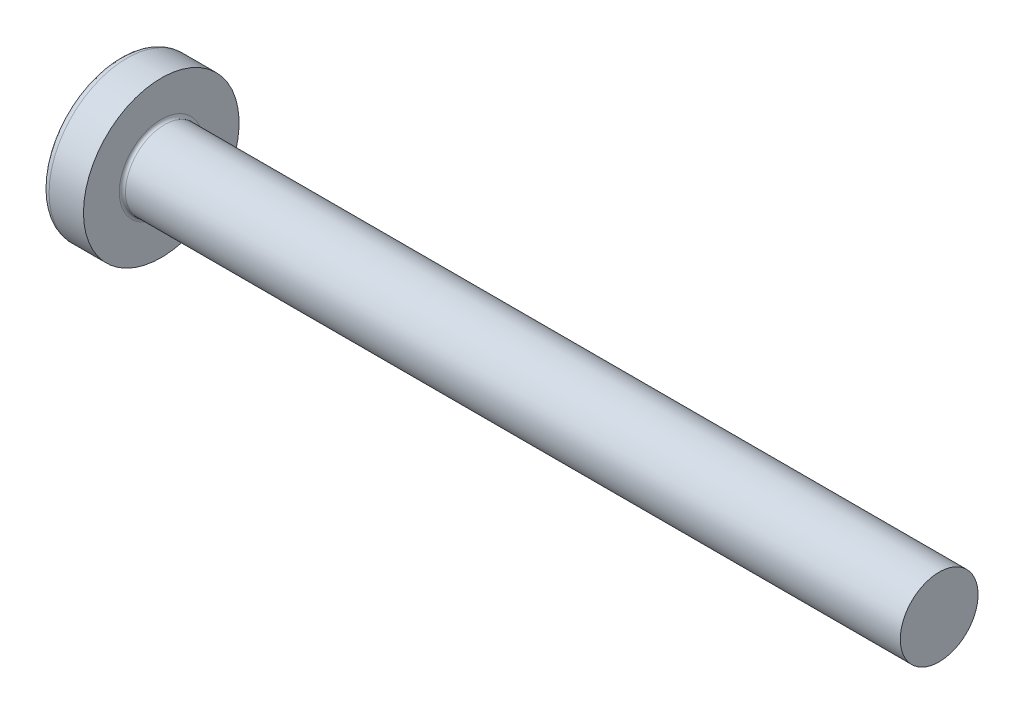
ISO-10303-21;
HEADER;
FILE_DESCRIPTION(('STEP AP214'),'2;1');
FILE_NAME('part.step','',(''),(''),'','','');
FILE_SCHEMA(('AUTOMOTIVE_DESIGN { 1 0 10303 214 1 1 1 1 }'));
ENDSEC;
DATA;
#1=APPLICATION_CONTEXT('core data for automotive mechanical design processes');
#2=APPLICATION_PROTOCOL_DEFINITION('international standard','automotive_design',2000,#1);
#3=PRODUCT_CONTEXT('',#1,'mechanical');
#4=PRODUCT('Part','Part','',(#3));
#5=PRODUCT_RELATED_PRODUCT_CATEGORY('part','',(#4));
#6=PRODUCT_DEFINITION_FORMATION('','',#4);
#7=PRODUCT_DEFINITION_CONTEXT('part definition',#1,'design');
#8=PRODUCT_DEFINITION('design','',#6,#7);
#9=PRODUCT_DEFINITION_SHAPE('','',#8);
#10=(LENGTH_UNIT() NAMED_UNIT(*) SI_UNIT(.MILLI.,.METRE.));
#11=(NAMED_UNIT(*) PLANE_ANGLE_UNIT() SI_UNIT($,.RADIAN.));
#12=(NAMED_UNIT(*) SI_UNIT($,.STERADIAN.) SOLID_ANGLE_UNIT());
#13=UNCERTAINTY_MEASURE_WITH_UNIT(LENGTH_MEASURE(1.E-05),#10,'distance_accuracy_value','');
#14=(GEOMETRIC_REPRESENTATION_CONTEXT(3) GLOBAL_UNCERTAINTY_ASSIGNED_CONTEXT((#13)) GLOBAL_UNIT_ASSIGNED_CONTEXT((#10,
#11,#12)) REPRESENTATION_CONTEXT('',''));
#15=CARTESIAN_POINT('',(0.,0.,0.));
#16=DIRECTION('',(0.,0.,1.));
#17=DIRECTION('',(1.,0.,0.));
#18=AXIS2_PLACEMENT_3D('',#15,#16,#17);
#19=CARTESIAN_POINT('',(4.,0.,0.));
#20=DIRECTION('',(-1.,0.,0.));
#21=DIRECTION('',(0.,1.,0.));
#22=AXIS2_PLACEMENT_3D('',#19,#20,#21);
#23=SPHERICAL_SURFACE('',#22,4.);
#24=CARTESIAN_POINT('',(0.803195914613464,0.,0.));
#25=DIRECTION('',(-1.,0.,0.));
#26=DIRECTION('',(0.,0.,1.));
#27=AXIS2_PLACEMENT_3D('',#24,#25,#26);
#28=CIRCLE('',#27,2.40425531914894);
#29=CARTESIAN_POINT('',(0.803195914613464,0.,2.40425531914894));
#30=VERTEX_POINT('',#29);
#31=EDGE_CURVE('E242',#30,#30,#28,.T.);
#32=ORIENTED_EDGE('',*,*,#31,.T.);
#33=EDGE_LOOP('',(#32));
#34=FACE_BOUND('',#33,.T.);
#35=CARTESIAN_POINT('',(0.0543400780062932,0.,0.));
#36=DIRECTION('',(1.,0.,0.));
#37=DIRECTION('',(0.,0.,-1.));
#38=AXIS2_PLACEMENT_3D('',#35,#36,#37);
#39=CIRCLE('',#38,0.657090389499513);
#40=CARTESIAN_POINT('',(0.0543400780062942,-0.369999999999998,-0.54301729251712));
#41=VERTEX_POINT('',#40);
#42=CARTESIAN_POINT('',(0.0543400780062936,-0.543017292517118,-0.37));
#43=VERTEX_POINT('',#42);
#44=EDGE_CURVE('E378',#41,#43,#39,.F.);
#45=ORIENTED_EDGE('',*,*,#44,.F.);
#46=CARTESIAN_POINT('',(4.,-0.37,0.));
#47=DIRECTION('',(0.,1.,0.));
#48=DIRECTION('',(0.,0.,1.));
#49=AXIS2_PLACEMENT_3D('',#46,#47,#48);
#50=CIRCLE('',#49,3.98285073785097);
#51=CARTESIAN_POINT('',(0.201999111211585,-0.369999999999996,-1.19928697514915));
#52=VERTEX_POINT('',#51);
#53=EDGE_CURVE('E304',#52,#41,#50,.T.);
#54=ORIENTED_EDGE('',*,*,#53,.F.);
#55=CARTESIAN_POINT('',(3.72274328891674,0.,0.556091024961349));
#56=DIRECTION('',(0.446197753347436,0.,-0.894934391398443));
#57=DIRECTION('',(-0.894934391398443,0.,-0.446197753347436));
#58=AXIS2_PLACEMENT_3D('',#55,#56,#57);
#59=CIRCLE('',#58,3.95144169742092);
#60=CARTESIAN_POINT('',(0.201999111211585,0.370000000000004,-1.19928697514915));
#61=VERTEX_POINT('',#60);
#62=EDGE_CURVE('E276',#52,#61,#59,.T.);
#63=ORIENTED_EDGE('',*,*,#62,.T.);
#64=CARTESIAN_POINT('',(4.,0.37,0.));
#65=DIRECTION('',(0.,-1.,0.));
#66=DIRECTION('',(0.,0.,-1.));
#67=AXIS2_PLACEMENT_3D('',#64,#65,#66);
#68=CIRCLE('',#67,3.98285073785097);
#69=CARTESIAN_POINT('',(0.0543400780062934,0.370000000000002,-0.543017292517118));
#70=VERTEX_POINT('',#69);
#71=EDGE_CURVE('E331',#70,#61,#68,.T.);
#72=ORIENTED_EDGE('',*,*,#71,.F.);
#73=CARTESIAN_POINT('',(0.0543400780062936,0.543017292517118,-0.37));
#74=VERTEX_POINT('',#73);
#75=EDGE_CURVE('E397',#74,#70,#39,.F.);
#76=ORIENTED_EDGE('',*,*,#75,.F.);
#77=CARTESIAN_POINT('',(4.,0.,-0.37));
#78=DIRECTION('',(0.,0.,1.));
#79=DIRECTION('',(1.,0.,0.));
#80=AXIS2_PLACEMENT_3D('',#77,#78,#79);
#81=CIRCLE('',#80,3.98285073785097);
#82=CARTESIAN_POINT('',(0.201999111211584,1.19928697514915,-0.37));
#83=VERTEX_POINT('',#82);
#84=EDGE_CURVE('E270',#83,#74,#81,.T.);
#85=ORIENTED_EDGE('',*,*,#84,.F.);
#86=CARTESIAN_POINT('',(3.72274328891674,-0.556091024961349,0.));
#87=DIRECTION('',(0.446197753347436,0.894934391398443,0.));
#88=DIRECTION('',(-0.894934391398443,0.446197753347436,0.));
#89=AXIS2_PLACEMENT_3D('',#86,#87,#88);
#90=CIRCLE('',#89,3.95144169742092);
#91=CARTESIAN_POINT('',(0.201999111211584,1.19928697514915,0.37));
#92=VERTEX_POINT('',#91);
#93=EDGE_CURVE('E273',#83,#92,#90,.T.);
#94=ORIENTED_EDGE('',*,*,#93,.T.);
#95=CARTESIAN_POINT('',(4.,0.,0.37));
#96=DIRECTION('',(0.,0.,-1.));
#97=DIRECTION('',(0.,1.,0.));
#98=AXIS2_PLACEMENT_3D('',#95,#96,#97);
#99=CIRCLE('',#98,3.98285073785097);
#100=CARTESIAN_POINT('',(0.0543400780062936,0.543017292517118,0.37));
#101=VERTEX_POINT('',#100);
#102=EDGE_CURVE('E266',#101,#92,#99,.T.);
#103=ORIENTED_EDGE('',*,*,#102,.F.);
#104=CARTESIAN_POINT('',(0.0543400780062942,0.369999999999998,0.54301729251712));
#105=VERTEX_POINT('',#104);
#106=EDGE_CURVE('E396',#105,#101,#39,.F.);
#107=ORIENTED_EDGE('',*,*,#106,.F.);
#108=CARTESIAN_POINT('',(0.201999111211584,0.369999999999996,1.19928697514916));
#109=VERTEX_POINT('',#108);
#110=EDGE_CURVE('E286',#109,#105,#68,.T.);
#111=ORIENTED_EDGE('',*,*,#110,.F.);
#112=CARTESIAN_POINT('',(3.72274328891674,0.,-0.556091024961349));
#113=DIRECTION('',(0.446197753347436,0.,0.894934391398443));
#114=DIRECTION('',(0.894934391398443,0.,-0.446197753347436));
#115=AXIS2_PLACEMENT_3D('',#112,#113,#114);
#116=CIRCLE('',#115,3.95144169742092);
#117=CARTESIAN_POINT('',(0.201999111211584,-0.370000000000004,1.19928697514915));
#118=VERTEX_POINT('',#117);
#119=EDGE_CURVE('E53',#109,#118,#116,.T.);
#120=ORIENTED_EDGE('',*,*,#119,.T.);
#121=CARTESIAN_POINT('',(0.0543400780062934,-0.370000000000002,0.543017292517118));
#122=VERTEX_POINT('',#121);
#123=EDGE_CURVE('E283',#122,#118,#50,.T.);
#124=ORIENTED_EDGE('',*,*,#123,.F.);
#125=CARTESIAN_POINT('',(0.0543400780062936,-0.543017292517118,0.37));
#126=VERTEX_POINT('',#125);
#127=EDGE_CURVE('E436',#126,#122,#39,.F.);
#128=ORIENTED_EDGE('',*,*,#127,.F.);
#129=CARTESIAN_POINT('',(0.201999111211585,-1.19928697514915,0.37));
#130=VERTEX_POINT('',#129);
#131=EDGE_CURVE('E267',#130,#126,#99,.T.);
#132=ORIENTED_EDGE('',*,*,#131,.F.);
#133=CARTESIAN_POINT('',(3.72274328891674,0.556091024961349,0.));
#134=DIRECTION('',(0.446197753347436,-0.894934391398443,0.));
#135=DIRECTION('',(0.894934391398443,0.446197753347436,0.));
#136=AXIS2_PLACEMENT_3D('',#133,#134,#135);
#137=CIRCLE('',#136,3.95144169742092);
#138=CARTESIAN_POINT('',(0.201999111211585,-1.19928697514915,-0.37));
#139=VERTEX_POINT('',#138);
#140=EDGE_CURVE('E263',#130,#139,#137,.T.);
#141=ORIENTED_EDGE('',*,*,#140,.T.);
#142=EDGE_CURVE('E68',#43,#139,#81,.T.);
#143=ORIENTED_EDGE('',*,*,#142,.F.);
#144=EDGE_LOOP('',(#45,#54,#63,#72,#76,#85,#94,#103,#107,#111,#120,#124,#128,#132,#141,#143));
#145=FACE_BOUND('',#144,.T.);
#146=ADVANCED_FACE('F39',(#34,#145),#23,.T.);
#147=CARTESIAN_POINT('',(1.5,0.552127712987655,-0.37));
#148=DIRECTION('',(0.,0.,1.));
#149=DIRECTION('',(1.,0.,0.));
#150=AXIS2_PLACEMENT_3D('',#147,#148,#149);
#151=PLANE('',#150);
#152=ORIENTED_EDGE('',*,*,#84,.T.);
#153=CARTESIAN_POINT('',(-0.98410748766867,0.628943903399942,-0.37));
#154=CARTESIAN_POINT('',(-0.783603343008974,0.612669947295736,-0.37));
#155=CARTESIAN_POINT('',(-0.583110931104086,0.596248129681141,-0.37));
#156=CARTESIAN_POINT('',(-0.182155788452108,0.562989164841715,-0.37));
#157=CARTESIAN_POINT('',(0.0183069414735531,0.546152007726029,-0.37));
#158=CARTESIAN_POINT('',(0.419186928470486,0.511943523152247,-0.37));
#159=CARTESIAN_POINT('',(0.61960418554543,0.4945721957373,-0.37));
#160=CARTESIAN_POINT('',(1.02037173794706,0.459102589125901,-0.37));
#161=CARTESIAN_POINT('',(1.22072203423871,0.441004320904958,-0.37));
#162=CARTESIAN_POINT('',(1.53631168775258,0.411665443099266,-0.37));
#163=CARTESIAN_POINT('',(1.65158348734209,0.400774467003839,-0.37));
#164=CARTESIAN_POINT('',(1.88208360561815,0.378547148308018,-0.37));
#165=CARTESIAN_POINT('',(1.99731192452822,0.367210808029326,-0.37));
#166=CARTESIAN_POINT('',(2.22771614129237,0.343963614894723,-0.37));
#167=CARTESIAN_POINT('',(2.34289203669079,0.332052737461392,-0.37));
#168=CARTESIAN_POINT('',(2.5731581934851,0.30741320876737,-0.37));
#169=CARTESIAN_POINT('',(2.68824845325022,0.294684542317204,-0.37));
#170=CARTESIAN_POINT('',(2.80327961663798,0.281425340988554,-0.37));
#171=B_SPLINE_CURVE_WITH_KNOTS('',3,(#153,#154,#155,#156,#157,#158,#159,#160,#161,#162,#163,
#164,#165,#166,#167,#168,#169,#170),.UNSPECIFIED.,.F.,.F.,(4,2,2,2,2,2,2,2,4),(0.,
0.603490856265068,1.20699609790343,1.81050129079257,2.41399737525255,2.7613521432415,
3.1087051006963,3.45607293033825,3.80344721379854),.UNSPECIFIED.);
#172=CARTESIAN_POINT('',(1.5,0.415013252800437,-0.370000000000001));
#173=VERTEX_POINT('',#172);
#174=EDGE_CURVE('E420',#74,#173,#171,.T.);
#175=ORIENTED_EDGE('',*,*,#174,.T.);
#176=DIRECTION('',(0.,1.,0.));
#177=VECTOR('',#176,1.);
#178=CARTESIAN_POINT('',(1.5,-0.552127712987656,-0.37));
#179=LINE('',#178,#177);
#180=CARTESIAN_POINT('',(1.5,0.552127712987655,-0.37));
#181=VERTEX_POINT('',#180);
#182=EDGE_CURVE('E360',#173,#181,#179,.T.);
#183=ORIENTED_EDGE('',*,*,#182,.T.);
#184=DIRECTION('',(0.894934391398443,-0.446197753347436,0.));
#185=VECTOR('',#184,1.);
#186=CARTESIAN_POINT('',(0.,1.3,-0.37));
#187=LINE('',#186,#185);
#188=EDGE_CURVE('E243',#83,#181,#187,.T.);
#189=ORIENTED_EDGE('',*,*,#188,.F.);
#190=EDGE_LOOP('',(#152,#175,#183,#189));
#191=FACE_BOUND('',#190,.T.);
#192=ADVANCED_FACE('F198',(#191),#151,.T.);
#193=CARTESIAN_POINT('',(1.5,-0.552127712987656,-0.37));
#194=VERTEX_POINT('',#193);
#195=CARTESIAN_POINT('',(1.5,-0.415013252800437,-0.370000000000001));
#196=VERTEX_POINT('',#195);
#197=EDGE_CURVE('E251',#194,#196,#179,.T.);
#198=ORIENTED_EDGE('',*,*,#197,.T.);
#199=CARTESIAN_POINT('',(-0.98410748766867,-0.628943903399942,-0.37));
#200=CARTESIAN_POINT('',(-0.783603343008974,-0.612669947295736,-0.37));
#201=CARTESIAN_POINT('',(-0.583110931104087,-0.596248129681141,-0.37));
#202=CARTESIAN_POINT('',(-0.182155788452109,-0.562989164841715,-0.37));
#203=CARTESIAN_POINT('',(0.0183069414735524,-0.546152007726029,-0.37));
#204=CARTESIAN_POINT('',(0.419186928470486,-0.511943523152247,-0.37));
#205=CARTESIAN_POINT('',(0.619604185545429,-0.4945721957373,-0.37));
#206=CARTESIAN_POINT('',(1.02037173794705,-0.4591025891259,-0.37));
#207=CARTESIAN_POINT('',(1.22072203423871,-0.441004320904958,-0.37));
#208=CARTESIAN_POINT('',(1.53631168775258,-0.411665443099266,-0.37));
#209=CARTESIAN_POINT('',(1.65158348734209,-0.400774467003839,-0.37));
#210=CARTESIAN_POINT('',(1.88208360561815,-0.378547148308018,-0.37));
#211=CARTESIAN_POINT('',(1.99731192452822,-0.367210808029325,-0.37));
#212=CARTESIAN_POINT('',(2.22771614129237,-0.343963614894723,-0.37));
#213=CARTESIAN_POINT('',(2.34289203669079,-0.332052737461392,-0.37));
#214=CARTESIAN_POINT('',(2.5731581934851,-0.30741320876737,-0.37));
#215=CARTESIAN_POINT('',(2.68824845325022,-0.294684542317204,-0.37));
#216=CARTESIAN_POINT('',(2.80327961663798,-0.281425340988554,-0.37));
#217=B_SPLINE_CURVE_WITH_KNOTS('',3,(#199,#200,#201,#202,#203,#204,#205,#206,#207,#208,#209,
#210,#211,#212,#213,#214,#215,#216),.UNSPECIFIED.,.F.,.F.,(4,2,2,2,2,2,2,2,4),(0.,
0.603490856265068,1.20699609790343,1.81050129079257,2.41399737525255,2.7613521432415,
3.1087051006963,3.45607293033825,3.80344721379854),.UNSPECIFIED.);
#218=EDGE_CURVE('E395',#196,#43,#217,.F.);
#219=ORIENTED_EDGE('',*,*,#218,.T.);
#220=ORIENTED_EDGE('',*,*,#142,.T.);
#221=DIRECTION('',(0.894934391398443,0.446197753347436,0.));
#222=VECTOR('',#221,1.);
#223=CARTESIAN_POINT('',(0.,-1.3,-0.37));
#224=LINE('',#223,#222);
#225=EDGE_CURVE('E334',#139,#194,#224,.T.);
#226=ORIENTED_EDGE('',*,*,#225,.T.);
#227=EDGE_LOOP('',(#198,#219,#220,#226));
#228=FACE_BOUND('',#227,.T.);
#229=ADVANCED_FACE('F204',(#228),#151,.T.);
#230=CARTESIAN_POINT('',(1.5,-0.552127712987656,0.37));
#231=DIRECTION('',(0.,0.,-1.));
#232=DIRECTION('',(0.,1.,0.));
#233=AXIS2_PLACEMENT_3D('',#230,#231,#232);
#234=PLANE('',#233);
#235=DIRECTION('',(0.,-1.,0.));
#236=VECTOR('',#235,1.);
#237=CARTESIAN_POINT('',(1.5,0.552127712987656,0.37));
#238=LINE('',#237,#236);
#239=CARTESIAN_POINT('',(1.5,0.552127712987655,0.37));
#240=VERTEX_POINT('',#239);
#241=CARTESIAN_POINT('',(1.5,0.415013252800437,0.370000000000001));
#242=VERTEX_POINT('',#241);
#243=EDGE_CURVE('E343',#240,#242,#238,.T.);
#244=ORIENTED_EDGE('',*,*,#243,.T.);
#245=CARTESIAN_POINT('',(-0.98410748766867,0.628943903399942,0.37));
#246=CARTESIAN_POINT('',(-0.783603343008974,0.612669947295736,0.37));
#247=CARTESIAN_POINT('',(-0.583110931104087,0.596248129681141,0.37));
#248=CARTESIAN_POINT('',(-0.182155788452109,0.562989164841715,0.37));
#249=CARTESIAN_POINT('',(0.0183069414735524,0.546152007726029,0.37));
#250=CARTESIAN_POINT('',(0.419186928470486,0.511943523152247,0.37));
#251=CARTESIAN_POINT('',(0.619604185545429,0.4945721957373,0.37));
#252=CARTESIAN_POINT('',(1.02037173794705,0.459102589125901,0.37));
#253=CARTESIAN_POINT('',(1.22072203423871,0.441004320904958,0.37));
#254=CARTESIAN_POINT('',(1.53631168775258,0.411665443099266,0.37));
#255=CARTESIAN_POINT('',(1.65158348734209,0.400774467003839,0.37));
#256=CARTESIAN_POINT('',(1.88208360561815,0.378547148308018,0.37));
#257=CARTESIAN_POINT('',(1.99731192452822,0.367210808029326,0.37));
#258=CARTESIAN_POINT('',(2.22771614129237,0.343963614894723,0.37));
#259=CARTESIAN_POINT('',(2.34289203669079,0.332052737461392,0.37));
#260=CARTESIAN_POINT('',(2.5731581934851,0.30741320876737,0.37));
#261=CARTESIAN_POINT('',(2.68824845325022,0.294684542317204,0.37));
#262=CARTESIAN_POINT('',(2.80327961663798,0.281425340988554,0.37));
#263=B_SPLINE_CURVE_WITH_KNOTS('',3,(#245,#246,#247,#248,#249,#250,#251,#252,#253,#254,#255,
#256,#257,#258,#259,#260,#261,#262),.UNSPECIFIED.,.F.,.F.,(4,2,2,2,2,2,2,2,4),(0.,
0.603490856265068,1.20699609790343,1.81050129079257,2.41399737525255,2.7613521432415,
3.1087051006963,3.45607293033825,3.80344721379855),.UNSPECIFIED.);
#264=EDGE_CURVE('E675',#242,#101,#263,.F.);
#265=ORIENTED_EDGE('',*,*,#264,.T.);
#266=ORIENTED_EDGE('',*,*,#102,.T.);
#267=DIRECTION('',(0.894934391398443,-0.446197753347436,0.));
#268=VECTOR('',#267,1.);
#269=CARTESIAN_POINT('',(0.,1.3,0.37));
#270=LINE('',#269,#268);
#271=EDGE_CURVE('E248',#92,#240,#270,.T.);
#272=ORIENTED_EDGE('',*,*,#271,.T.);
#273=EDGE_LOOP('',(#244,#265,#266,#272));
#274=FACE_BOUND('',#273,.T.);
#275=ADVANCED_FACE('F416',(#274),#234,.T.);
#276=ORIENTED_EDGE('',*,*,#131,.T.);
#277=CARTESIAN_POINT('',(-0.98410748766867,-0.628943903399942,0.37));
#278=CARTESIAN_POINT('',(-0.783603343008974,-0.612669947295736,0.37));
#279=CARTESIAN_POINT('',(-0.583110931104086,-0.596248129681141,0.37));
#280=CARTESIAN_POINT('',(-0.182155788452109,-0.562989164841715,0.37));
#281=CARTESIAN_POINT('',(0.0183069414735529,-0.546152007726029,0.37));
#282=CARTESIAN_POINT('',(0.419186928470486,-0.511943523152247,0.37));
#283=CARTESIAN_POINT('',(0.61960418554543,-0.4945721957373,0.37));
#284=CARTESIAN_POINT('',(1.02037173794706,-0.459102589125901,0.37));
#285=CARTESIAN_POINT('',(1.22072203423871,-0.441004320904958,0.37));
#286=CARTESIAN_POINT('',(1.53631168775258,-0.411665443099266,0.37));
#287=CARTESIAN_POINT('',(1.65158348734209,-0.400774467003839,0.37));
#288=CARTESIAN_POINT('',(1.88208360561815,-0.378547148308018,0.37));
#289=CARTESIAN_POINT('',(1.99731192452822,-0.367210808029326,0.37));
#290=CARTESIAN_POINT('',(2.22771614129237,-0.343963614894723,0.37));
#291=CARTESIAN_POINT('',(2.34289203669079,-0.332052737461392,0.37));
#292=CARTESIAN_POINT('',(2.5731581934851,-0.307413208767371,0.37));
#293=CARTESIAN_POINT('',(2.68824845325022,-0.294684542317204,0.37));
#294=CARTESIAN_POINT('',(2.80327961663798,-0.281425340988554,0.37));
#295=B_SPLINE_CURVE_WITH_KNOTS('',3,(#277,#278,#279,#280,#281,#282,#283,#284,#285,#286,#287,
#288,#289,#290,#291,#292,#293,#294),.UNSPECIFIED.,.F.,.F.,(4,2,2,2,2,2,2,2,4),(0.,
0.603490856265068,1.20699609790343,1.81050129079257,2.41399737525255,2.7613521432415,
3.1087051006963,3.45607293033825,3.80344721379854),.UNSPECIFIED.);
#296=CARTESIAN_POINT('',(1.5,-0.415013252800437,0.370000000000001));
#297=VERTEX_POINT('',#296);
#298=EDGE_CURVE('E437',#126,#297,#295,.T.);
#299=ORIENTED_EDGE('',*,*,#298,.T.);
#300=CARTESIAN_POINT('',(1.5,-0.552127712987656,0.37));
#301=VERTEX_POINT('',#300);
#302=EDGE_CURVE('E345',#297,#301,#238,.T.);
#303=ORIENTED_EDGE('',*,*,#302,.T.);
#304=DIRECTION('',(0.894934391398443,0.446197753347436,0.));
#305=VECTOR('',#304,1.);
#306=CARTESIAN_POINT('',(0.,-1.3,0.37));
#307=LINE('',#306,#305);
#308=EDGE_CURVE('E336',#130,#301,#307,.T.);
#309=ORIENTED_EDGE('',*,*,#308,.F.);
#310=EDGE_LOOP('',(#276,#299,#303,#309));
#311=FACE_BOUND('',#310,.T.);
#312=ADVANCED_FACE('F523',(#311),#234,.T.);
#313=CARTESIAN_POINT('',(1.5,0.552127712987656,0.37));
#314=DIRECTION('',(0.446197753347436,0.894934391398443,0.));
#315=DIRECTION('',(-0.894934391398443,0.446197753347436,0.));
#316=AXIS2_PLACEMENT_3D('',#313,#314,#315);
#317=PLANE('',#316);
#318=CARTESIAN_POINT('',(2.47007552564217,0.0684659783631794,0.));
#319=DIRECTION('',(0.446197753347436,0.894934391398443,0.));
#320=DIRECTION('',(-0.894934391398443,0.446197753347436,0.));
#321=AXIS2_PLACEMENT_3D('',#318,#319,#320);
#322=ELLIPSE('',#321,1.0940568559235,0.483340636970288);
#323=CARTESIAN_POINT('',(1.5,0.552127712987657,0.0655056375514318));
#324=VERTEX_POINT('',#323);
#325=CARTESIAN_POINT('',(1.5,0.552127712987657,-0.0655056375514318));
#326=VERTEX_POINT('',#325);
#327=EDGE_CURVE('E309',#324,#326,#322,.F.);
#328=ORIENTED_EDGE('',*,*,#327,.F.);
#329=DIRECTION('',(0.,0.,-1.));
#330=VECTOR('',#329,1.);
#331=CARTESIAN_POINT('',(1.5,0.552127712987656,0.37));
#332=LINE('',#331,#330);
#333=EDGE_CURVE('E346',#240,#324,#332,.T.);
#334=ORIENTED_EDGE('',*,*,#333,.F.);
#335=ORIENTED_EDGE('',*,*,#271,.F.);
#336=ORIENTED_EDGE('',*,*,#93,.F.);
#337=ORIENTED_EDGE('',*,*,#188,.T.);
#338=EDGE_CURVE('E348',#326,#181,#332,.T.);
#339=ORIENTED_EDGE('',*,*,#338,.F.);
#340=EDGE_LOOP('',(#328,#334,#335,#336,#337,#339));
#341=FACE_BOUND('',#340,.T.);
#342=ADVANCED_FACE('F414',(#341),#317,.F.);
#343=CARTESIAN_POINT('',(0.,-1.3,-0.37));
#344=DIRECTION('',(0.446197753347436,-0.894934391398443,0.));
#345=DIRECTION('',(0.894934391398443,0.446197753347436,0.));
#346=AXIS2_PLACEMENT_3D('',#343,#344,#345);
#347=PLANE('',#346);
#348=CARTESIAN_POINT('',(2.47007552564217,-0.0684659783631794,0.));
#349=DIRECTION('',(0.446197753347436,-0.894934391398443,0.));
#350=DIRECTION('',(-0.894934391398443,-0.446197753347436,0.));
#351=AXIS2_PLACEMENT_3D('',#348,#349,#350);
#352=ELLIPSE('',#351,1.0940568559235,0.483340636970288);
#353=CARTESIAN_POINT('',(1.5,-0.552127712987657,-0.0655056375514327));
#354=VERTEX_POINT('',#353);
#355=CARTESIAN_POINT('',(1.5,-0.552127712987657,0.0655056375514325));
#356=VERTEX_POINT('',#355);
#357=EDGE_CURVE('E677',#354,#356,#352,.F.);
#358=ORIENTED_EDGE('',*,*,#357,.F.);
#359=DIRECTION('',(0.,0.,1.));
#360=VECTOR('',#359,1.);
#361=CARTESIAN_POINT('',(1.5,-0.552127712987656,-0.37));
#362=LINE('',#361,#360);
#363=EDGE_CURVE('E339',#194,#354,#362,.T.);
#364=ORIENTED_EDGE('',*,*,#363,.F.);
#365=ORIENTED_EDGE('',*,*,#225,.F.);
#366=ORIENTED_EDGE('',*,*,#140,.F.);
#367=ORIENTED_EDGE('',*,*,#308,.T.);
#368=EDGE_CURVE('E342',#356,#301,#362,.T.);
#369=ORIENTED_EDGE('',*,*,#368,.F.);
#370=EDGE_LOOP('',(#358,#364,#365,#366,#367,#369));
#371=FACE_BOUND('',#370,.T.);
#372=ADVANCED_FACE('F510',(#371),#347,.F.);
#373=CARTESIAN_POINT('',(1.5,0.552127712987656,-0.37));
#374=DIRECTION('',(-1.,0.,0.));
#375=DIRECTION('',(0.,0.,1.));
#376=AXIS2_PLACEMENT_3D('',#373,#374,#375);
#377=PLANE('',#376);
#378=DIRECTION('',(0.,1.,0.));
#379=VECTOR('',#378,1.);
#380=CARTESIAN_POINT('',(1.5,-0.370000000000002,0.552127712987654));
#381=LINE('',#380,#379);
#382=CARTESIAN_POINT('',(1.5,-0.370000000000002,0.552127712987654));
#383=VERTEX_POINT('',#382);
#384=CARTESIAN_POINT('',(1.5,-0.0655056375514445,0.552127712987656));
#385=VERTEX_POINT('',#384);
#386=EDGE_CURVE('E324',#383,#385,#381,.T.);
#387=ORIENTED_EDGE('',*,*,#386,.T.);
#388=CARTESIAN_POINT('',(1.5,0.,0.));
#389=DIRECTION('',(-1.,0.,0.));
#390=DIRECTION('',(0.,0.,1.));
#391=AXIS2_PLACEMENT_3D('',#388,#389,#390);
#392=CIRCLE('',#391,0.556);
#393=CARTESIAN_POINT('',(1.5,-0.370000000000001,0.415013252800436));
#394=VERTEX_POINT('',#393);
#395=EDGE_CURVE('E705',#394,#385,#392,.T.);
#396=ORIENTED_EDGE('',*,*,#395,.F.);
#397=DIRECTION('',(0.,0.,-1.));
#398=VECTOR('',#397,1.);
#399=CARTESIAN_POINT('',(1.5,-0.370000000000002,0.552127712987654));
#400=LINE('',#399,#398);
#401=EDGE_CURVE('E320',#383,#394,#400,.T.);
#402=ORIENTED_EDGE('',*,*,#401,.F.);
#403=EDGE_LOOP('',(#387,#396,#402));
#404=FACE_BOUND('',#403,.T.);
#405=ADVANCED_FACE('F503',(#404),#377,.T.);
#406=ORIENTED_EDGE('',*,*,#302,.F.);
#407=EDGE_CURVE('E710',#356,#297,#392,.T.);
#408=ORIENTED_EDGE('',*,*,#407,.F.);
#409=ORIENTED_EDGE('',*,*,#368,.T.);
#410=EDGE_LOOP('',(#406,#408,#409));
#411=FACE_BOUND('',#410,.T.);
#412=ADVANCED_FACE('F496',(#411),#377,.T.);
#413=ORIENTED_EDGE('',*,*,#363,.T.);
#414=EDGE_CURVE('E389',#196,#354,#392,.T.);
#415=ORIENTED_EDGE('',*,*,#414,.F.);
#416=ORIENTED_EDGE('',*,*,#197,.F.);
#417=EDGE_LOOP('',(#413,#415,#416));
#418=FACE_BOUND('',#417,.T.);
#419=ADVANCED_FACE('F490',(#418),#377,.T.);
#420=CARTESIAN_POINT('',(1.5,-0.369999999999998,-0.415013252800437));
#421=VERTEX_POINT('',#420);
#422=CARTESIAN_POINT('',(1.5,-0.369999999999998,-0.552127712987657));
#423=VERTEX_POINT('',#422);
#424=EDGE_CURVE('E323',#421,#423,#400,.T.);
#425=ORIENTED_EDGE('',*,*,#424,.F.);
#426=CARTESIAN_POINT('',(1.5,-0.0655056375514398,-0.552127712987656));
#427=VERTEX_POINT('',#426);
#428=EDGE_CURVE('E60',#427,#421,#392,.T.);
#429=ORIENTED_EDGE('',*,*,#428,.F.);
#430=DIRECTION('',(0.,-1.,0.));
#431=VECTOR('',#430,1.);
#432=CARTESIAN_POINT('',(1.5,0.370000000000002,-0.552127712987654));
#433=LINE('',#432,#431);
#434=EDGE_CURVE('E319',#427,#423,#433,.T.);
#435=ORIENTED_EDGE('',*,*,#434,.T.);
#436=EDGE_LOOP('',(#425,#429,#435));
#437=FACE_BOUND('',#436,.T.);
#438=ADVANCED_FACE('F384',(#437),#377,.T.);
#439=CARTESIAN_POINT('',(1.5,0.370000000000002,-0.552127712987654));
#440=VERTEX_POINT('',#439);
#441=CARTESIAN_POINT('',(1.5,0.0655056375514436,-0.552127712987656));
#442=VERTEX_POINT('',#441);
#443=EDGE_CURVE('E316',#440,#442,#433,.T.);
#444=ORIENTED_EDGE('',*,*,#443,.T.);
#445=CARTESIAN_POINT('',(1.5,0.370000000000001,-0.415013252800436));
#446=VERTEX_POINT('',#445);
#447=EDGE_CURVE('E388',#446,#442,#392,.T.);
#448=ORIENTED_EDGE('',*,*,#447,.F.);
#449=DIRECTION('',(0.,0.,1.));
#450=VECTOR('',#449,1.);
#451=CARTESIAN_POINT('',(1.5,0.370000000000002,-0.552127712987654));
#452=LINE('',#451,#450);
#453=EDGE_CURVE('E328',#440,#446,#452,.T.);
#454=ORIENTED_EDGE('',*,*,#453,.F.);
#455=EDGE_LOOP('',(#444,#448,#454));
#456=FACE_BOUND('',#455,.T.);
#457=ADVANCED_FACE('F478',(#456),#377,.T.);
#458=ORIENTED_EDGE('',*,*,#182,.F.);
#459=EDGE_CURVE('E694',#326,#173,#392,.T.);
#460=ORIENTED_EDGE('',*,*,#459,.F.);
#461=ORIENTED_EDGE('',*,*,#338,.T.);
#462=EDGE_LOOP('',(#458,#460,#461));
#463=FACE_BOUND('',#462,.T.);
#464=ADVANCED_FACE('F471',(#463),#377,.T.);
#465=ORIENTED_EDGE('',*,*,#333,.T.);
#466=EDGE_CURVE('E696',#242,#324,#392,.T.);
#467=ORIENTED_EDGE('',*,*,#466,.F.);
#468=ORIENTED_EDGE('',*,*,#243,.F.);
#469=EDGE_LOOP('',(#465,#467,#468));
#470=FACE_BOUND('',#469,.T.);
#471=ADVANCED_FACE('F465',(#470),#377,.T.);
#472=CARTESIAN_POINT('',(1.5,0.369999999999998,0.552127712987657));
#473=DIRECTION('',(0.,-1.,0.));
#474=DIRECTION('',(1.,0.,0.));
#475=AXIS2_PLACEMENT_3D('',#472,#473,#474);
#476=PLANE('',#475);
#477=ORIENTED_EDGE('',*,*,#110,.T.);
#478=CARTESIAN_POINT('',(-0.98410748766867,0.369999999999998,0.628943903399943));
#479=CARTESIAN_POINT('',(-0.783603343008974,0.369999999999998,0.612669947295737));
#480=CARTESIAN_POINT('',(-0.583110931104087,0.369999999999998,0.596248129681142));
#481=CARTESIAN_POINT('',(-0.182155788452109,0.369999999999998,0.562989164841716));
#482=CARTESIAN_POINT('',(0.0183069414735524,0.369999999999998,0.546152007726031));
#483=CARTESIAN_POINT('',(0.419186928470486,0.369999999999998,0.511943523152249));
#484=CARTESIAN_POINT('',(0.619604185545429,0.369999999999998,0.494572195737301));
#485=CARTESIAN_POINT('',(1.02037173794705,0.369999999999998,0.459102589125902));
#486=CARTESIAN_POINT('',(1.22072203423871,0.369999999999998,0.44100432090496));
#487=CARTESIAN_POINT('',(1.53631168775258,0.369999999999999,0.411665443099267));
#488=CARTESIAN_POINT('',(1.65158348734209,0.369999999999999,0.40077446700384));
#489=CARTESIAN_POINT('',(1.88208360561815,0.369999999999999,0.37854714830802));
#490=CARTESIAN_POINT('',(1.99731192452821,0.369999999999999,0.367210808029327));
#491=CARTESIAN_POINT('',(2.22771614129237,0.369999999999999,0.343963614894724));
#492=CARTESIAN_POINT('',(2.34289203669079,0.369999999999999,0.332052737461393));
#493=CARTESIAN_POINT('',(2.5731581934851,0.369999999999999,0.307413208767372));
#494=CARTESIAN_POINT('',(2.68824845325022,0.369999999999999,0.294684542317205));
#495=CARTESIAN_POINT('',(2.80327961663798,0.369999999999999,0.281425340988555));
#496=B_SPLINE_CURVE_WITH_KNOTS('',3,(#478,#479,#480,#481,#482,#483,#484,#485,#486,#487,#488,
#489,#490,#491,#492,#493,#494,#495),.UNSPECIFIED.,.F.,.F.,(4,2,2,2,2,2,2,2,4),(0.,
0.603490856265068,1.20699609790343,1.81050129079257,2.41399737525255,2.7613521432415,
3.1087051006963,3.45607293033825,3.80344721379854),.UNSPECIFIED.);
#497=CARTESIAN_POINT('',(1.5,0.369999999999999,0.415013252800439));
#498=VERTEX_POINT('',#497);
#499=EDGE_CURVE('E674',#105,#498,#496,.T.);
#500=ORIENTED_EDGE('',*,*,#499,.T.);
#501=CARTESIAN_POINT('',(1.5,0.369999999999998,0.552127712987657));
#502=VERTEX_POINT('',#501);
#503=EDGE_CURVE('E301',#498,#502,#452,.T.);
#504=ORIENTED_EDGE('',*,*,#503,.T.);
#505=DIRECTION('',(0.894934391398443,0.,-0.446197753347436));
#506=VECTOR('',#505,1.);
#507=CARTESIAN_POINT('',(0.,0.369999999999995,1.3));
#508=LINE('',#507,#506);
#509=EDGE_CURVE('E294',#109,#502,#508,.T.);
#510=ORIENTED_EDGE('',*,*,#509,.F.);
#511=EDGE_LOOP('',(#477,#500,#504,#510));
#512=FACE_BOUND('',#511,.T.);
#513=ADVANCED_FACE('F298',(#512),#476,.T.);
#514=CARTESIAN_POINT('',(1.5,-0.369999999999998,-0.552127712987657));
#515=DIRECTION('',(0.,1.,0.));
#516=DIRECTION('',(0.,0.,1.));
#517=AXIS2_PLACEMENT_3D('',#514,#515,#516);
#518=PLANE('',#517);
#519=ORIENTED_EDGE('',*,*,#401,.T.);
#520=CARTESIAN_POINT('',(-0.98410748766867,-0.370000000000002,0.62894390339994));
#521=CARTESIAN_POINT('',(-0.783603343008974,-0.370000000000002,0.612669947295734));
#522=CARTESIAN_POINT('',(-0.583110931104086,-0.370000000000002,0.59624812968114));
#523=CARTESIAN_POINT('',(-0.182155788452108,-0.370000000000002,0.562989164841714));
#524=CARTESIAN_POINT('',(0.0183069414735531,-0.370000000000002,0.546152007726028));
#525=CARTESIAN_POINT('',(0.419186928470486,-0.370000000000002,0.511943523152246));
#526=CARTESIAN_POINT('',(0.61960418554543,-0.370000000000002,0.494572195737299));
#527=CARTESIAN_POINT('',(1.02037173794706,-0.370000000000002,0.459102589125899));
#528=CARTESIAN_POINT('',(1.22072203423871,-0.370000000000001,0.441004320904957));
#529=CARTESIAN_POINT('',(1.53631168775258,-0.370000000000001,0.411665443099264));
#530=CARTESIAN_POINT('',(1.65158348734209,-0.370000000000001,0.400774467003838));
#531=CARTESIAN_POINT('',(1.88208360561815,-0.370000000000001,0.378547148308017));
#532=CARTESIAN_POINT('',(1.99731192452822,-0.370000000000001,0.367210808029324));
#533=CARTESIAN_POINT('',(2.22771614129237,-0.370000000000001,0.343963614894722));
#534=CARTESIAN_POINT('',(2.34289203669079,-0.370000000000001,0.33205273746139));
#535=CARTESIAN_POINT('',(2.5731581934851,-0.370000000000001,0.307413208767369));
#536=CARTESIAN_POINT('',(2.68824845325022,-0.370000000000001,0.294684542317202));
#537=CARTESIAN_POINT('',(2.80327961663798,-0.370000000000001,0.281425340988552));
#538=B_SPLINE_CURVE_WITH_KNOTS('',3,(#520,#521,#522,#523,#524,#525,#526,#527,#528,#529,#530,
#531,#532,#533,#534,#535,#536,#537),.UNSPECIFIED.,.F.,.F.,(4,2,2,2,2,2,2,2,4),(0.,
0.603490856265068,1.20699609790343,1.81050129079257,2.41399737525255,2.7613521432415,
3.1087051006963,3.45607293033825,3.80344721379854),.UNSPECIFIED.);
#539=EDGE_CURVE('E429',#394,#122,#538,.F.);
#540=ORIENTED_EDGE('',*,*,#539,.T.);
#541=ORIENTED_EDGE('',*,*,#123,.T.);
#542=DIRECTION('',(0.894934391398443,0.,-0.446197753347436));
#543=VECTOR('',#542,1.);
#544=CARTESIAN_POINT('',(0.,-0.370000000000005,1.3));
#545=LINE('',#544,#543);
#546=EDGE_CURVE('E296',#118,#383,#545,.T.);
#547=ORIENTED_EDGE('',*,*,#546,.T.);
#548=EDGE_LOOP('',(#519,#540,#541,#547));
#549=FACE_BOUND('',#548,.T.);
#550=ADVANCED_FACE('F233',(#549),#518,.T.);
#551=CARTESIAN_POINT('',(1.5,-0.370000000000002,0.552127712987654));
#552=DIRECTION('',(0.446197753347436,0.,0.894934391398443));
#553=DIRECTION('',(-0.894934391398443,0.,0.446197753347436));
#554=AXIS2_PLACEMENT_3D('',#551,#552,#553);
#555=PLANE('',#554);
#556=CARTESIAN_POINT('',(2.47007552564217,0.,0.0684659783631794));
#557=DIRECTION('',(0.446197753347436,0.,0.894934391398443));
#558=DIRECTION('',(-0.894934391398443,0.,0.446197753347436));
#559=AXIS2_PLACEMENT_3D('',#556,#557,#558);
#560=ELLIPSE('',#559,1.0940568559235,0.483340636970288);
#561=CARTESIAN_POINT('',(1.5,0.0655056375514406,0.552127712987656));
#562=VERTEX_POINT('',#561);
#563=EDGE_CURVE('E427',#385,#562,#560,.F.);
#564=ORIENTED_EDGE('',*,*,#563,.F.);
#565=ORIENTED_EDGE('',*,*,#386,.F.);
#566=ORIENTED_EDGE('',*,*,#546,.F.);
#567=ORIENTED_EDGE('',*,*,#119,.F.);
#568=ORIENTED_EDGE('',*,*,#509,.T.);
#569=EDGE_CURVE('E327',#562,#502,#381,.T.);
#570=ORIENTED_EDGE('',*,*,#569,.F.);
#571=EDGE_LOOP('',(#564,#565,#566,#567,#568,#570));
#572=FACE_BOUND('',#571,.T.);
#573=ADVANCED_FACE('F292',(#572),#555,.F.);
#574=CARTESIAN_POINT('',(0.,0.370000000000005,-1.3));
#575=DIRECTION('',(0.446197753347436,0.,-0.894934391398443));
#576=DIRECTION('',(0.894934391398443,0.,0.446197753347436));
#577=AXIS2_PLACEMENT_3D('',#574,#575,#576);
#578=PLANE('',#577);
#579=CARTESIAN_POINT('',(2.47007552564217,0.,-0.0684659783631795));
#580=DIRECTION('',(0.446197753347436,0.,-0.894934391398443));
#581=DIRECTION('',(-0.894934391398443,0.,-0.446197753347436));
#582=AXIS2_PLACEMENT_3D('',#579,#580,#581);
#583=ELLIPSE('',#582,1.0940568559235,0.483340636970288);
#584=EDGE_CURVE('E382',#442,#427,#583,.F.);
#585=ORIENTED_EDGE('',*,*,#584,.F.);
#586=ORIENTED_EDGE('',*,*,#443,.F.);
#587=DIRECTION('',(0.894934391398443,0.,0.446197753347436));
#588=VECTOR('',#587,1.);
#589=CARTESIAN_POINT('',(0.,0.370000000000005,-1.3));
#590=LINE('',#589,#588);
#591=EDGE_CURVE('E306',#61,#440,#590,.T.);
#592=ORIENTED_EDGE('',*,*,#591,.F.);
#593=ORIENTED_EDGE('',*,*,#62,.F.);
#594=DIRECTION('',(0.894934391398443,0.,0.446197753347436));
#595=VECTOR('',#594,1.);
#596=CARTESIAN_POINT('',(0.,-0.369999999999995,-1.3));
#597=LINE('',#596,#595);
#598=EDGE_CURVE('E313',#52,#423,#597,.T.);
#599=ORIENTED_EDGE('',*,*,#598,.T.);
#600=ORIENTED_EDGE('',*,*,#434,.F.);
#601=EDGE_LOOP('',(#585,#586,#592,#593,#599,#600));
#602=FACE_BOUND('',#601,.T.);
#603=ADVANCED_FACE('F373',(#602),#578,.F.);
#604=ORIENTED_EDGE('',*,*,#453,.T.);
#605=CARTESIAN_POINT('',(-0.984107487670367,0.370000000000002,-0.628943903400078));
#606=CARTESIAN_POINT('',(-0.783603343010497,0.370000000000002,-0.612669947295859));
#607=CARTESIAN_POINT('',(-0.583110931105435,0.370000000000002,-0.596248129681251));
#608=CARTESIAN_POINT('',(-0.182155788453109,0.370000000000002,-0.562989164841798));
#609=CARTESIAN_POINT('',(0.0183069414727269,0.370000000000002,-0.546152007726098));
#610=CARTESIAN_POINT('',(0.419186928470243,0.370000000000002,-0.511943523152268));
#611=CARTESIAN_POINT('',(0.619604185545594,0.370000000000002,-0.494572195737285));
#612=CARTESIAN_POINT('',(1.02037173794803,0.370000000000002,-0.459102589125812));
#613=CARTESIAN_POINT('',(1.2207220342401,0.370000000000001,-0.441004320904831));
#614=CARTESIAN_POINT('',(1.53631168775438,0.370000000000001,-0.411665443099096));
#615=CARTESIAN_POINT('',(1.65158348734389,0.370000000000001,-0.400774467003667));
#616=CARTESIAN_POINT('',(1.88208360561995,0.370000000000001,-0.378547148307842));
#617=CARTESIAN_POINT('',(1.99731192453001,0.370000000000001,-0.367210808029146));
#618=CARTESIAN_POINT('',(2.22771614129417,0.370000000000001,-0.343963614894538));
#619=CARTESIAN_POINT('',(2.34289203669258,0.370000000000001,-0.332052737461203));
#620=CARTESIAN_POINT('',(2.57315819348689,0.370000000000001,-0.307413208767173));
#621=CARTESIAN_POINT('',(2.68824845325201,0.370000000000001,-0.294684542317002));
#622=CARTESIAN_POINT('',(2.80327961663977,0.370000000000001,-0.281425340988346));
#623=B_SPLINE_CURVE_WITH_KNOTS('',3,(#605,#606,#607,#608,#609,#610,#611,#612,#613,#614,#615,
#616,#617,#618,#619,#620,#621,#622),.UNSPECIFIED.,.F.,.F.,(4,2,2,2,2,2,2,2,4),(0.,
0.603490856265593,1.20699609790448,1.81050129079485,2.41399737525605,2.76135214324501,
3.1087051006998,3.45607293034176,3.80344721380205),.UNSPECIFIED.);
#624=EDGE_CURVE('E369',#446,#70,#623,.F.);
#625=ORIENTED_EDGE('',*,*,#624,.T.);
#626=ORIENTED_EDGE('',*,*,#71,.T.);
#627=ORIENTED_EDGE('',*,*,#591,.T.);
#628=EDGE_LOOP('',(#604,#625,#626,#627));
#629=FACE_BOUND('',#628,.T.);
#630=ADVANCED_FACE('F231',(#629),#476,.T.);
#631=ORIENTED_EDGE('',*,*,#53,.T.);
#632=CARTESIAN_POINT('',(-0.984107487670368,-0.369999999999998,-0.628943903400081));
#633=CARTESIAN_POINT('',(-0.783603343010499,-0.369999999999998,-0.612669947295861));
#634=CARTESIAN_POINT('',(-0.583110931105436,-0.369999999999998,-0.596248129681253));
#635=CARTESIAN_POINT('',(-0.18215578845311,-0.369999999999998,-0.5629891648418));
#636=CARTESIAN_POINT('',(0.0183069414727264,-0.369999999999998,-0.546152007726101));
#637=CARTESIAN_POINT('',(0.419186928470242,-0.369999999999998,-0.51194352315227));
#638=CARTESIAN_POINT('',(0.619604185545593,-0.369999999999998,-0.494572195737287));
#639=CARTESIAN_POINT('',(1.02037173794803,-0.369999999999998,-0.459102589125815));
#640=CARTESIAN_POINT('',(1.22072203424009,-0.369999999999998,-0.441004320904834));
#641=CARTESIAN_POINT('',(1.53631168775438,-0.369999999999998,-0.411665443099098));
#642=CARTESIAN_POINT('',(1.65158348734388,-0.369999999999998,-0.40077446700367));
#643=CARTESIAN_POINT('',(1.88208360561995,-0.369999999999999,-0.378547148307845));
#644=CARTESIAN_POINT('',(1.99731192453001,-0.369999999999999,-0.367210808029149));
#645=CARTESIAN_POINT('',(2.22771614129417,-0.369999999999999,-0.343963614894541));
#646=CARTESIAN_POINT('',(2.34289203669258,-0.369999999999999,-0.332052737461206));
#647=CARTESIAN_POINT('',(2.57315819348689,-0.369999999999999,-0.307413208767176));
#648=CARTESIAN_POINT('',(2.68824845325201,-0.369999999999999,-0.294684542317004));
#649=CARTESIAN_POINT('',(2.80327961663977,-0.369999999999999,-0.281425340988348));
#650=B_SPLINE_CURVE_WITH_KNOTS('',3,(#632,#633,#634,#635,#636,#637,#638,#639,#640,#641,#642,
#643,#644,#645,#646,#647,#648,#649),.UNSPECIFIED.,.F.,.F.,(4,2,2,2,2,2,2,2,4),(0.,
0.603490856265593,1.20699609790448,1.81050129079485,2.41399737525605,2.76135214324501,
3.1087051006998,3.45607293034176,3.80344721380205),.UNSPECIFIED.);
#651=EDGE_CURVE('E11',#41,#421,#650,.T.);
#652=ORIENTED_EDGE('',*,*,#651,.T.);
#653=ORIENTED_EDGE('',*,*,#424,.T.);
#654=ORIENTED_EDGE('',*,*,#598,.F.);
#655=EDGE_LOOP('',(#631,#652,#653,#654));
#656=FACE_BOUND('',#655,.T.);
#657=ADVANCED_FACE('F226',(#656),#518,.T.);
#658=CARTESIAN_POINT('',(-25.4,0.,0.));
#659=DIRECTION('',(-1.,0.,0.));
#660=DIRECTION('',(0.,0.,1.));
#661=AXIS2_PLACEMENT_3D('',#658,#659,#660);
#662=CYLINDRICAL_SURFACE('',#661,1.25);
#663=CARTESIAN_POINT('',(2.2,0.,0.));
#664=DIRECTION('',(-1.,0.,0.));
#665=DIRECTION('',(0.,0.,1.));
#666=AXIS2_PLACEMENT_3D('',#663,#664,#665);
#667=CIRCLE('',#666,1.25);
#668=CARTESIAN_POINT('',(2.2,0.,1.25));
#669=VERTEX_POINT('',#668);
#670=EDGE_CURVE('E237',#669,#669,#667,.F.);
#671=ORIENTED_EDGE('',*,*,#670,.T.);
#672=EDGE_LOOP('',(#671));
#673=FACE_BOUND('',#672,.T.);
#674=CARTESIAN_POINT('',(27.1,0.,0.));
#675=DIRECTION('',(-1.,0.,0.));
#676=DIRECTION('',(0.,0.,1.));
#677=AXIS2_PLACEMENT_3D('',#674,#675,#676);
#678=CIRCLE('',#677,1.25);
#679=CARTESIAN_POINT('',(27.1,0.,1.25));
#680=VERTEX_POINT('',#679);
#681=EDGE_CURVE('E240',#680,#680,#678,.T.);
#682=ORIENTED_EDGE('',*,*,#681,.T.);
#683=EDGE_LOOP('',(#682));
#684=FACE_BOUND('',#683,.T.);
#685=ADVANCED_FACE('F223',(#673,#684),#662,.T.);
#686=CARTESIAN_POINT('',(2.1,1.25,0.));
#687=DIRECTION('',(-1.,0.,0.));
#688=DIRECTION('',(0.,0.,1.));
#689=AXIS2_PLACEMENT_3D('',#686,#687,#688);
#690=PLANE('',#689);
#691=CARTESIAN_POINT('',(2.1,0.,0.));
#692=DIRECTION('',(-1.,0.,0.));
#693=DIRECTION('',(0.,0.,1.));
#694=AXIS2_PLACEMENT_3D('',#691,#692,#693);
#695=CIRCLE('',#694,1.35);
#696=CARTESIAN_POINT('',(2.1,0.,1.35));
#697=VERTEX_POINT('',#696);
#698=EDGE_CURVE('E259',#697,#697,#695,.T.);
#699=ORIENTED_EDGE('',*,*,#698,.T.);
#700=EDGE_LOOP('',(#699));
#701=FACE_BOUND('',#700,.T.);
#702=CARTESIAN_POINT('',(2.1,0.,0.));
#703=DIRECTION('',(-1.,0.,0.));
#704=DIRECTION('',(0.,0.,1.));
#705=AXIS2_PLACEMENT_3D('',#702,#703,#704);
#706=CIRCLE('',#705,2.5);
#707=CARTESIAN_POINT('',(2.1,0.,2.5));
#708=VERTEX_POINT('',#707);
#709=EDGE_CURVE('E256',#708,#708,#706,.T.);
#710=ORIENTED_EDGE('',*,*,#709,.F.);
#711=EDGE_LOOP('',(#710));
#712=FACE_BOUND('',#711,.T.);
#713=ADVANCED_FACE('F220',(#701,#712),#690,.F.);
#714=CARTESIAN_POINT('',(-25.4,0.,0.));
#715=DIRECTION('',(-1.,0.,0.));
#716=DIRECTION('',(0.,0.,1.));
#717=AXIS2_PLACEMENT_3D('',#714,#715,#716);
#718=CYLINDRICAL_SURFACE('',#717,2.5);
#719=ORIENTED_EDGE('',*,*,#709,.T.);
#720=EDGE_LOOP('',(#719));
#721=FACE_BOUND('',#720,.T.);
#722=CARTESIAN_POINT('',(0.995004159736655,0.,0.));
#723=DIRECTION('',(-1.,0.,0.));
#724=DIRECTION('',(0.,0.,1.));
#725=AXIS2_PLACEMENT_3D('',#722,#723,#724);
#726=CIRCLE('',#725,2.5);
#727=CARTESIAN_POINT('',(0.995004159736655,0.,2.5));
#728=VERTEX_POINT('',#727);
#729=EDGE_CURVE('E245',#728,#728,#726,.T.);
#730=ORIENTED_EDGE('',*,*,#729,.F.);
#731=EDGE_LOOP('',(#730));
#732=FACE_BOUND('',#731,.T.);
#733=ADVANCED_FACE('F216',(#721,#732),#718,.T.);
#734=CARTESIAN_POINT('',(0.995004159736656,0.,0.));
#735=DIRECTION('',(-1.,0.,0.));
#736=DIRECTION('',(0.,0.,1.));
#737=AXIS2_PLACEMENT_3D('',#734,#735,#736);
#738=TOROIDAL_SURFACE('',#737,2.26,0.24);
#739=ORIENTED_EDGE('',*,*,#729,.T.);
#740=EDGE_LOOP('',(#739));
#741=FACE_BOUND('',#740,.T.);
#742=ORIENTED_EDGE('',*,*,#31,.F.);
#743=EDGE_LOOP('',(#742));
#744=FACE_BOUND('',#743,.T.);
#745=ADVANCED_FACE('F213',(#741,#744),#738,.T.);
#746=CARTESIAN_POINT('',(27.1,1.25,0.));
#747=DIRECTION('',(1.,0.,0.));
#748=DIRECTION('',(0.,0.,-1.));
#749=AXIS2_PLACEMENT_3D('',#746,#747,#748);
#750=PLANE('',#749);
#751=ORIENTED_EDGE('',*,*,#681,.F.);
#752=EDGE_LOOP('',(#751));
#753=FACE_BOUND('',#752,.T.);
#754=ADVANCED_FACE('F211',(#753),#750,.T.);
#755=CARTESIAN_POINT('',(2.2,0.,0.));
#756=DIRECTION('',(-1.,0.,0.));
#757=DIRECTION('',(0.,0.,1.));
#758=AXIS2_PLACEMENT_3D('',#755,#756,#757);
#759=TOROIDAL_SURFACE('',#758,1.35,0.1);
#760=ORIENTED_EDGE('',*,*,#670,.F.);
#761=EDGE_LOOP('',(#760));
#762=FACE_BOUND('',#761,.T.);
#763=ORIENTED_EDGE('',*,*,#698,.F.);
#764=EDGE_LOOP('',(#763));
#765=FACE_BOUND('',#764,.T.);
#766=ADVANCED_FACE('F41',(#762,#765),#759,.F.);
#767=ORIENTED_EDGE('',*,*,#503,.F.);
#768=EDGE_CURVE('E390',#562,#498,#392,.T.);
#769=ORIENTED_EDGE('',*,*,#768,.F.);
#770=ORIENTED_EDGE('',*,*,#569,.T.);
#771=EDGE_LOOP('',(#767,#769,#770));
#772=FACE_BOUND('',#771,.T.);
#773=ADVANCED_FACE('F472',(#772),#377,.T.);
#774=CARTESIAN_POINT('',(1.5,0.,0.));
#775=DIRECTION('',(-1.,0.,0.));
#776=DIRECTION('',(0.,0.,1.));
#777=AXIS2_PLACEMENT_3D('',#774,#775,#776);
#778=CONICAL_SURFACE('',#777,0.556,0.069813170079766);
#779=ORIENTED_EDGE('',*,*,#327,.T.);
#780=EDGE_CURVE('E691',#324,#326,#392,.T.);
#781=ORIENTED_EDGE('',*,*,#780,.F.);
#782=EDGE_LOOP('',(#779,#781));
#783=FACE_BOUND('',#782,.T.);
#784=ADVANCED_FACE('F195',(#783),#778,.F.);
#785=ORIENTED_EDGE('',*,*,#357,.T.);
#786=EDGE_CURVE('E711',#354,#356,#392,.T.);
#787=ORIENTED_EDGE('',*,*,#786,.F.);
#788=EDGE_LOOP('',(#785,#787));
#789=FACE_BOUND('',#788,.T.);
#790=ADVANCED_FACE('F605',(#789),#778,.F.);
#791=EDGE_CURVE('E392',#498,#242,#392,.T.);
#792=ORIENTED_EDGE('',*,*,#791,.F.);
#793=ORIENTED_EDGE('',*,*,#499,.F.);
#794=ORIENTED_EDGE('',*,*,#106,.T.);
#795=ORIENTED_EDGE('',*,*,#264,.F.);
#796=EDGE_LOOP('',(#792,#793,#794,#795));
#797=FACE_BOUND('',#796,.T.);
#798=ADVANCED_FACE('F611',(#797),#778,.F.);
#799=ORIENTED_EDGE('',*,*,#563,.T.);
#800=EDGE_CURVE('E393',#385,#562,#392,.T.);
#801=ORIENTED_EDGE('',*,*,#800,.F.);
#802=EDGE_LOOP('',(#799,#801));
#803=FACE_BOUND('',#802,.T.);
#804=ADVANCED_FACE('F618',(#803),#778,.F.);
#805=ORIENTED_EDGE('',*,*,#584,.T.);
#806=EDGE_CURVE('E385',#442,#427,#392,.T.);
#807=ORIENTED_EDGE('',*,*,#806,.F.);
#808=EDGE_LOOP('',(#805,#807));
#809=FACE_BOUND('',#808,.T.);
#810=ADVANCED_FACE('F625',(#809),#778,.F.);
#811=ORIENTED_EDGE('',*,*,#127,.T.);
#812=ORIENTED_EDGE('',*,*,#539,.F.);
#813=EDGE_CURVE('E707',#297,#394,#392,.T.);
#814=ORIENTED_EDGE('',*,*,#813,.F.);
#815=ORIENTED_EDGE('',*,*,#298,.F.);
#816=EDGE_LOOP('',(#811,#812,#814,#815));
#817=FACE_BOUND('',#816,.T.);
#818=ADVANCED_FACE('F632',(#817),#778,.F.);
#819=ORIENTED_EDGE('',*,*,#75,.T.);
#820=ORIENTED_EDGE('',*,*,#624,.F.);
#821=EDGE_CURVE('E697',#173,#446,#392,.T.);
#822=ORIENTED_EDGE('',*,*,#821,.F.);
#823=ORIENTED_EDGE('',*,*,#174,.F.);
#824=EDGE_LOOP('',(#819,#820,#822,#823));
#825=FACE_BOUND('',#824,.T.);
#826=ADVANCED_FACE('F193',(#825),#778,.F.);
#827=EDGE_CURVE('E386',#421,#196,#392,.T.);
#828=ORIENTED_EDGE('',*,*,#827,.F.);
#829=ORIENTED_EDGE('',*,*,#651,.F.);
#830=ORIENTED_EDGE('',*,*,#44,.T.);
#831=ORIENTED_EDGE('',*,*,#218,.F.);
#832=EDGE_LOOP('',(#828,#829,#830,#831));
#833=FACE_BOUND('',#832,.T.);
#834=ADVANCED_FACE('F188',(#833),#778,.F.);
#835=CARTESIAN_POINT('',(1.68065535110549,0.,0.));
#836=DIRECTION('',(-1.,0.,0.));
#837=DIRECTION('',(0.,0.,1.));
#838=AXIS2_PLACEMENT_3D('',#835,#836,#837);
#839=CONICAL_SURFACE('',#838,0.,1.25663706143592);
#840=ORIENTED_EDGE('',*,*,#768,.T.);
#841=ORIENTED_EDGE('',*,*,#791,.T.);
#842=ORIENTED_EDGE('',*,*,#466,.T.);
#843=ORIENTED_EDGE('',*,*,#780,.T.);
#844=ORIENTED_EDGE('',*,*,#459,.T.);
#845=ORIENTED_EDGE('',*,*,#821,.T.);
#846=ORIENTED_EDGE('',*,*,#447,.T.);
#847=ORIENTED_EDGE('',*,*,#806,.T.);
#848=ORIENTED_EDGE('',*,*,#428,.T.);
#849=ORIENTED_EDGE('',*,*,#827,.T.);
#850=ORIENTED_EDGE('',*,*,#414,.T.);
#851=ORIENTED_EDGE('',*,*,#786,.T.);
#852=ORIENTED_EDGE('',*,*,#407,.T.);
#853=ORIENTED_EDGE('',*,*,#813,.T.);
#854=ORIENTED_EDGE('',*,*,#395,.T.);
#855=ORIENTED_EDGE('',*,*,#800,.T.);
#856=EDGE_LOOP('',(#840,#841,#842,#843,#844,#845,#846,#847,#848,#849,#850,#851,#852,#853,#854,#855));
#857=FACE_BOUND('',#856,.T.);
#858=CARTESIAN_POINT('',(1.68065535110549,0.,0.));
#859=VERTEX_POINT('',#858);
#860=VERTEX_LOOP('',#859);
#861=FACE_BOUND('',#860,.T.);
#862=ADVANCED_FACE('F186',(#857,#861),#839,.F.);
#863=CLOSED_SHELL('',(#146,#192,#229,#275,#312,#342,#372,#405,#412,#419,#438,#457,#464,#471,
#513,#550,#573,#603,#630,#657,#685,#713,#733,#745,#754,#766,#773,#784,#790,#798,#804,#810,#818,
#826,#834,#862));
#864=MANIFOLD_SOLID_BREP('B2',#863);
#865=ADVANCED_BREP_SHAPE_REPRESENTATION('',(#18,#864),#14);
#866=SHAPE_DEFINITION_REPRESENTATION(#9,#865);
ENDSEC;
END-ISO-10303-21;
